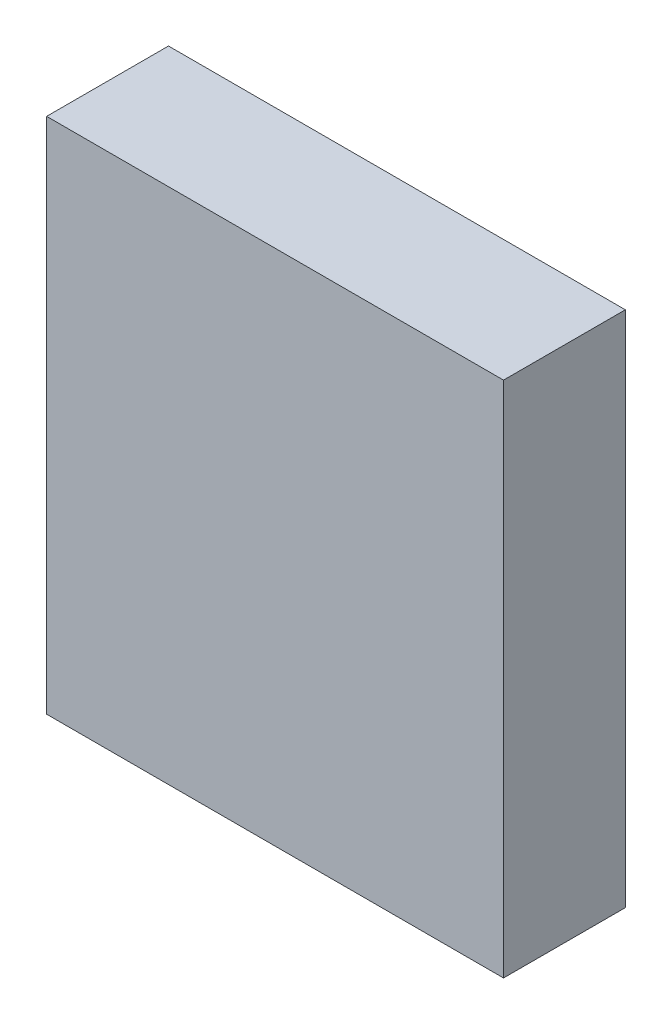
ISO-10303-21;
HEADER;
FILE_DESCRIPTION(('STEP AP214'),'2;1');
FILE_NAME('part.step','',(''),(''),'','','');
FILE_SCHEMA(('AUTOMOTIVE_DESIGN { 1 0 10303 214 1 1 1 1 }'));
ENDSEC;
DATA;
#1=APPLICATION_CONTEXT('core data for automotive mechanical design processes');
#2=APPLICATION_PROTOCOL_DEFINITION('international standard','automotive_design',2000,#1);
#3=PRODUCT_CONTEXT('',#1,'mechanical');
#4=PRODUCT('Part','Part','',(#3));
#5=PRODUCT_RELATED_PRODUCT_CATEGORY('part','',(#4));
#6=PRODUCT_DEFINITION_FORMATION('','',#4);
#7=PRODUCT_DEFINITION_CONTEXT('part definition',#1,'design');
#8=PRODUCT_DEFINITION('design','',#6,#7);
#9=PRODUCT_DEFINITION_SHAPE('','',#8);
#10=(LENGTH_UNIT() NAMED_UNIT(*) SI_UNIT(.MILLI.,.METRE.));
#11=(NAMED_UNIT(*) PLANE_ANGLE_UNIT() SI_UNIT($,.RADIAN.));
#12=(NAMED_UNIT(*) SI_UNIT($,.STERADIAN.) SOLID_ANGLE_UNIT());
#13=UNCERTAINTY_MEASURE_WITH_UNIT(LENGTH_MEASURE(1.E-05),#10,'distance_accuracy_value','');
#14=(GEOMETRIC_REPRESENTATION_CONTEXT(3) GLOBAL_UNCERTAINTY_ASSIGNED_CONTEXT((#13)) GLOBAL_UNIT_ASSIGNED_CONTEXT((#10,
#11,#12)) REPRESENTATION_CONTEXT('',''));
#15=CARTESIAN_POINT('',(0.,0.,0.));
#16=DIRECTION('',(0.,0.,1.));
#17=DIRECTION('',(1.,0.,0.));
#18=AXIS2_PLACEMENT_3D('',#15,#16,#17);
#19=CARTESIAN_POINT('',(-2.25000058,2.54999998,1.20000014));
#20=DIRECTION('',(0.,0.,1.));
#21=DIRECTION('',(1.,0.,0.));
#22=AXIS2_PLACEMENT_3D('',#19,#20,#21);
#23=PLANE('',#22);
#24=DIRECTION('',(0.,1.,0.));
#25=VECTOR('',#24,1.);
#26=CARTESIAN_POINT('',(2.25000058,2.54999998,1.20000014));
#27=LINE('',#26,#25);
#28=CARTESIAN_POINT('',(2.25000058,2.54999998,1.20000014));
#29=VERTEX_POINT('',#28);
#30=CARTESIAN_POINT('',(2.25000058,-2.54999998,1.20000014));
#31=VERTEX_POINT('',#30);
#32=EDGE_CURVE('E53',#29,#31,#27,.F.);
#33=ORIENTED_EDGE('',*,*,#32,.F.);
#34=DIRECTION('',(1.,0.,0.));
#35=VECTOR('',#34,1.);
#36=CARTESIAN_POINT('',(-2.25000058,2.54999998,1.20000014));
#37=LINE('',#36,#35);
#38=CARTESIAN_POINT('',(-2.25000058,2.54999998,1.20000014));
#39=VERTEX_POINT('',#38);
#40=EDGE_CURVE('E68',#39,#29,#37,.T.);
#41=ORIENTED_EDGE('',*,*,#40,.F.);
#42=DIRECTION('',(0.,1.,0.));
#43=VECTOR('',#42,1.);
#44=CARTESIAN_POINT('',(-2.25000058,-2.54999998,1.20000014));
#45=LINE('',#44,#43);
#46=CARTESIAN_POINT('',(-2.25000058,-2.54999998,1.20000014));
#47=VERTEX_POINT('',#46);
#48=EDGE_CURVE('E20',#47,#39,#45,.T.);
#49=ORIENTED_EDGE('',*,*,#48,.F.);
#50=DIRECTION('',(1.,0.,0.));
#51=VECTOR('',#50,1.);
#52=CARTESIAN_POINT('',(2.25000058,-2.54999998,1.20000014));
#53=LINE('',#52,#51);
#54=EDGE_CURVE('E58',#31,#47,#53,.F.);
#55=ORIENTED_EDGE('',*,*,#54,.F.);
#56=EDGE_LOOP('',(#33,#41,#49,#55));
#57=FACE_BOUND('',#56,.T.);
#58=ADVANCED_FACE('F17',(#57),#23,.T.);
#59=CARTESIAN_POINT('',(-2.25000058,-2.54999998,0.));
#60=DIRECTION('',(-1.,0.,0.));
#61=DIRECTION('',(0.,0.,1.));
#62=AXIS2_PLACEMENT_3D('',#59,#60,#61);
#63=PLANE('',#62);
#64=DIRECTION('',(0.,0.,1.));
#65=VECTOR('',#64,1.);
#66=CARTESIAN_POINT('',(-2.25000058,2.54999998,0.));
#67=LINE('',#66,#65);
#68=CARTESIAN_POINT('',(-2.25000058,2.54999998,0.));
#69=VERTEX_POINT('',#68);
#70=EDGE_CURVE('E79',#69,#39,#67,.T.);
#71=ORIENTED_EDGE('',*,*,#70,.F.);
#72=DIRECTION('',(0.,1.,0.));
#73=VECTOR('',#72,1.);
#74=CARTESIAN_POINT('',(-2.25000058,2.54999998,0.));
#75=LINE('',#74,#73);
#76=CARTESIAN_POINT('',(-2.25000058,-2.54999998,0.));
#77=VERTEX_POINT('',#76);
#78=EDGE_CURVE('E74',#69,#77,#75,.F.);
#79=ORIENTED_EDGE('',*,*,#78,.T.);
#80=DIRECTION('',(0.,0.,-1.));
#81=VECTOR('',#80,1.);
#82=CARTESIAN_POINT('',(-2.25000058,-2.54999998,0.));
#83=LINE('',#82,#81);
#84=EDGE_CURVE('E63',#47,#77,#83,.T.);
#85=ORIENTED_EDGE('',*,*,#84,.F.);
#86=ORIENTED_EDGE('',*,*,#48,.T.);
#87=EDGE_LOOP('',(#71,#79,#85,#86));
#88=FACE_BOUND('',#87,.T.);
#89=ADVANCED_FACE('F73',(#88),#63,.T.);
#90=CARTESIAN_POINT('',(2.25000058,-2.54999998,0.));
#91=DIRECTION('',(0.,-1.,0.));
#92=DIRECTION('',(0.,0.,-1.));
#93=AXIS2_PLACEMENT_3D('',#90,#91,#92);
#94=PLANE('',#93);
#95=ORIENTED_EDGE('',*,*,#84,.T.);
#96=DIRECTION('',(1.,0.,0.));
#97=VECTOR('',#96,1.);
#98=CARTESIAN_POINT('',(-2.25000058,-2.54999998,0.));
#99=LINE('',#98,#97);
#100=CARTESIAN_POINT('',(2.25000058,-2.54999998,0.));
#101=VERTEX_POINT('',#100);
#102=EDGE_CURVE('E84',#77,#101,#99,.T.);
#103=ORIENTED_EDGE('',*,*,#102,.T.);
#104=DIRECTION('',(0.,0.,-1.));
#105=VECTOR('',#104,1.);
#106=CARTESIAN_POINT('',(2.25000058,-2.54999998,0.));
#107=LINE('',#106,#105);
#108=EDGE_CURVE('E65',#31,#101,#107,.T.);
#109=ORIENTED_EDGE('',*,*,#108,.F.);
#110=ORIENTED_EDGE('',*,*,#54,.T.);
#111=EDGE_LOOP('',(#95,#103,#109,#110));
#112=FACE_BOUND('',#111,.T.);
#113=ADVANCED_FACE('F60',(#112),#94,.T.);
#114=CARTESIAN_POINT('',(2.25000058,2.54999998,0.));
#115=DIRECTION('',(1.,0.,0.));
#116=DIRECTION('',(0.,0.,-1.));
#117=AXIS2_PLACEMENT_3D('',#114,#115,#116);
#118=PLANE('',#117);
#119=ORIENTED_EDGE('',*,*,#108,.T.);
#120=DIRECTION('',(0.,1.,0.));
#121=VECTOR('',#120,1.);
#122=CARTESIAN_POINT('',(2.25000058,2.54999998,0.));
#123=LINE('',#122,#121);
#124=CARTESIAN_POINT('',(2.25000058,2.54999998,0.));
#125=VERTEX_POINT('',#124);
#126=EDGE_CURVE('E26',#101,#125,#123,.T.);
#127=ORIENTED_EDGE('',*,*,#126,.T.);
#128=DIRECTION('',(0.,0.,1.));
#129=VECTOR('',#128,1.);
#130=CARTESIAN_POINT('',(2.25000058,2.54999998,0.));
#131=LINE('',#130,#129);
#132=EDGE_CURVE('E34',#29,#125,#131,.F.);
#133=ORIENTED_EDGE('',*,*,#132,.F.);
#134=ORIENTED_EDGE('',*,*,#32,.T.);
#135=EDGE_LOOP('',(#119,#127,#133,#134));
#136=FACE_BOUND('',#135,.T.);
#137=ADVANCED_FACE('F88',(#136),#118,.T.);
#138=CARTESIAN_POINT('',(-2.25000058,2.54999998,0.));
#139=DIRECTION('',(0.,1.,0.));
#140=DIRECTION('',(0.,0.,1.));
#141=AXIS2_PLACEMENT_3D('',#138,#139,#140);
#142=PLANE('',#141);
#143=ORIENTED_EDGE('',*,*,#132,.T.);
#144=DIRECTION('',(1.,0.,0.));
#145=VECTOR('',#144,1.);
#146=CARTESIAN_POINT('',(-2.25000058,2.54999998,0.));
#147=LINE('',#146,#145);
#148=EDGE_CURVE('E11',#125,#69,#147,.F.);
#149=ORIENTED_EDGE('',*,*,#148,.T.);
#150=ORIENTED_EDGE('',*,*,#70,.T.);
#151=ORIENTED_EDGE('',*,*,#40,.T.);
#152=EDGE_LOOP('',(#143,#149,#150,#151));
#153=FACE_BOUND('',#152,.T.);
#154=ADVANCED_FACE('F91',(#153),#142,.T.);
#155=CARTESIAN_POINT('',(-2.25000058,2.54999998,0.));
#156=DIRECTION('',(0.,0.,1.));
#157=DIRECTION('',(1.,0.,0.));
#158=AXIS2_PLACEMENT_3D('',#155,#156,#157);
#159=PLANE('',#158);
#160=ORIENTED_EDGE('',*,*,#126,.F.);
#161=ORIENTED_EDGE('',*,*,#102,.F.);
#162=ORIENTED_EDGE('',*,*,#78,.F.);
#163=ORIENTED_EDGE('',*,*,#148,.F.);
#164=EDGE_LOOP('',(#160,#161,#162,#163));
#165=FACE_BOUND('',#164,.T.);
#166=ADVANCED_FACE('F90',(#165),#159,.F.);
#167=CLOSED_SHELL('',(#58,#89,#113,#137,#154,#166));
#168=MANIFOLD_SOLID_BREP('B1',#167);
#169=ADVANCED_BREP_SHAPE_REPRESENTATION('',(#18,#168),#14);
#170=SHAPE_DEFINITION_REPRESENTATION(#9,#169);
ENDSEC;
END-ISO-10303-21;
